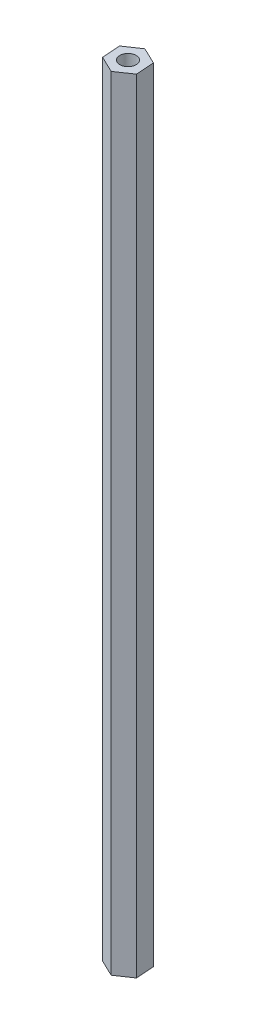
ISO-10303-21;
HEADER;
FILE_DESCRIPTION(('STEP AP214'),'2;1');
FILE_NAME('part.step','',(''),(''),'','','');
FILE_SCHEMA(('AUTOMOTIVE_DESIGN { 1 0 10303 214 1 1 1 1 }'));
ENDSEC;
DATA;
#1=APPLICATION_CONTEXT('core data for automotive mechanical design processes');
#2=APPLICATION_PROTOCOL_DEFINITION('international standard','automotive_design',2000,#1);
#3=PRODUCT_CONTEXT('',#1,'mechanical');
#4=PRODUCT('Part','Part','',(#3));
#5=PRODUCT_RELATED_PRODUCT_CATEGORY('part','',(#4));
#6=PRODUCT_DEFINITION_FORMATION('','',#4);
#7=PRODUCT_DEFINITION_CONTEXT('part definition',#1,'design');
#8=PRODUCT_DEFINITION('design','',#6,#7);
#9=PRODUCT_DEFINITION_SHAPE('','',#8);
#10=(LENGTH_UNIT() NAMED_UNIT(*) SI_UNIT(.MILLI.,.METRE.));
#11=(NAMED_UNIT(*) PLANE_ANGLE_UNIT() SI_UNIT($,.RADIAN.));
#12=(NAMED_UNIT(*) SI_UNIT($,.STERADIAN.) SOLID_ANGLE_UNIT());
#13=UNCERTAINTY_MEASURE_WITH_UNIT(LENGTH_MEASURE(1.E-05),#10,'distance_accuracy_value','');
#14=(GEOMETRIC_REPRESENTATION_CONTEXT(3) GLOBAL_UNCERTAINTY_ASSIGNED_CONTEXT((#13)) GLOBAL_UNIT_ASSIGNED_CONTEXT((#10,
#11,#12)) REPRESENTATION_CONTEXT('',''));
#15=CARTESIAN_POINT('',(0.,0.,0.));
#16=DIRECTION('',(0.,0.,1.));
#17=DIRECTION('',(1.,0.,0.));
#18=AXIS2_PLACEMENT_3D('',#15,#16,#17);
#19=CARTESIAN_POINT('',(6.60730990121914,157.099,3.1791176767438));
#20=DIRECTION('',(-0.997178072559764,0.,0.0750725755918522));
#21=DIRECTION('',(0.0750725755918522,0.,0.997178072559764));
#22=AXIS2_PLACEMENT_3D('',#19,#20,#21);
#23=PLANE('',#22);
#24=DIRECTION('',(-0.0750725755918522,0.,-0.997178072559764));
#25=VECTOR('',#24,1.);
#26=CARTESIAN_POINT('',(6.60730990121914,-157.099,3.1791176767438));
#27=LINE('',#26,#25);
#28=CARTESIAN_POINT('',(6.60730990121914,-157.099,3.1791176767438));
#29=VERTEX_POINT('',#28);
#30=CARTESIAN_POINT('',(6.05685162028986,-157.099,-4.13253938676032));
#31=VERTEX_POINT('',#30);
#32=EDGE_CURVE('E121',#29,#31,#27,.T.);
#33=ORIENTED_EDGE('',*,*,#32,.T.);
#34=DIRECTION('',(0.,-1.,0.));
#35=VECTOR('',#34,1.);
#36=CARTESIAN_POINT('',(6.05685162028986,157.099,-4.13253938676032));
#37=LINE('',#36,#35);
#38=CARTESIAN_POINT('',(6.05685162028986,157.099,-4.13253938676032));
#39=VERTEX_POINT('',#38);
#40=EDGE_CURVE('E11',#39,#31,#37,.T.);
#41=ORIENTED_EDGE('',*,*,#40,.F.);
#42=DIRECTION('',(-0.0750725755918522,0.,-0.997178072559764));
#43=VECTOR('',#42,1.);
#44=CARTESIAN_POINT('',(6.60730990121914,157.099,3.1791176767438));
#45=LINE('',#44,#43);
#46=CARTESIAN_POINT('',(6.60730990121914,157.099,3.1791176767438));
#47=VERTEX_POINT('',#46);
#48=EDGE_CURVE('E132',#47,#39,#45,.T.);
#49=ORIENTED_EDGE('',*,*,#48,.F.);
#50=DIRECTION('',(0.,-1.,0.));
#51=VECTOR('',#50,1.);
#52=CARTESIAN_POINT('',(6.60730990121914,157.099,3.1791176767438));
#53=LINE('',#52,#51);
#54=EDGE_CURVE('E117',#47,#29,#53,.T.);
#55=ORIENTED_EDGE('',*,*,#54,.T.);
#56=EDGE_LOOP('',(#33,#41,#49,#55));
#57=FACE_BOUND('',#56,.T.);
#58=ADVANCED_FACE('F37',(#57),#23,.F.);
#59=CARTESIAN_POINT('',(6.05685162028986,157.099,-4.13253938676032));
#60=DIRECTION('',(-0.433574278689811,0.,0.901117830729484));
#61=DIRECTION('',(0.901117830729484,0.,0.433574278689811));
#62=AXIS2_PLACEMENT_3D('',#59,#60,#61);
#63=PLANE('',#62);
#64=DIRECTION('',(-0.901117830729484,0.,-0.433574278689811));
#65=VECTOR('',#64,1.);
#66=CARTESIAN_POINT('',(6.05685162028986,-157.099,-4.13253938676032));
#67=LINE('',#66,#65);
#68=CARTESIAN_POINT('',(-0.55045828092927,-157.099,-7.31165706350412));
#69=VERTEX_POINT('',#68);
#70=EDGE_CURVE('E124',#31,#69,#67,.T.);
#71=ORIENTED_EDGE('',*,*,#70,.T.);
#72=DIRECTION('',(0.,-1.,0.));
#73=VECTOR('',#72,1.);
#74=CARTESIAN_POINT('',(-0.55045828092927,157.099,-7.31165706350412));
#75=LINE('',#74,#73);
#76=CARTESIAN_POINT('',(-0.55045828092927,157.099,-7.31165706350412));
#77=VERTEX_POINT('',#76);
#78=EDGE_CURVE('E45',#77,#69,#75,.T.);
#79=ORIENTED_EDGE('',*,*,#78,.F.);
#80=DIRECTION('',(-0.901117830729484,0.,-0.433574278689811));
#81=VECTOR('',#80,1.);
#82=CARTESIAN_POINT('',(6.05685162028986,157.099,-4.13253938676032));
#83=LINE('',#82,#81);
#84=EDGE_CURVE('E90',#39,#77,#83,.T.);
#85=ORIENTED_EDGE('',*,*,#84,.F.);
#86=ORIENTED_EDGE('',*,*,#40,.T.);
#87=EDGE_LOOP('',(#71,#79,#85,#86));
#88=FACE_BOUND('',#87,.T.);
#89=ADVANCED_FACE('F157',(#88),#63,.F.);
#90=CARTESIAN_POINT('',(-0.55045828092927,157.099,-7.31165706350412));
#91=DIRECTION('',(0.563603793869954,0.,0.826045255137632));
#92=DIRECTION('',(0.826045255137632,0.,-0.563603793869954));
#93=AXIS2_PLACEMENT_3D('',#90,#91,#92);
#94=PLANE('',#93);
#95=DIRECTION('',(-0.826045255137632,0.,0.563603793869954));
#96=VECTOR('',#95,1.);
#97=CARTESIAN_POINT('',(-0.55045828092927,-157.099,-7.31165706350412));
#98=LINE('',#97,#96);
#99=CARTESIAN_POINT('',(-6.60730990121914,-157.099,-3.1791176767438));
#100=VERTEX_POINT('',#99);
#101=EDGE_CURVE('E127',#69,#100,#98,.T.);
#102=ORIENTED_EDGE('',*,*,#101,.T.);
#103=DIRECTION('',(0.,-1.,0.));
#104=VECTOR('',#103,1.);
#105=CARTESIAN_POINT('',(-6.60730990121914,157.099,-3.1791176767438));
#106=LINE('',#105,#104);
#107=CARTESIAN_POINT('',(-6.60730990121914,157.099,-3.1791176767438));
#108=VERTEX_POINT('',#107);
#109=EDGE_CURVE('E112',#108,#100,#106,.T.);
#110=ORIENTED_EDGE('',*,*,#109,.F.);
#111=DIRECTION('',(-0.826045255137632,0.,0.563603793869954));
#112=VECTOR('',#111,1.);
#113=CARTESIAN_POINT('',(-0.55045828092927,157.099,-7.31165706350412));
#114=LINE('',#113,#112);
#115=EDGE_CURVE('E103',#77,#108,#114,.T.);
#116=ORIENTED_EDGE('',*,*,#115,.F.);
#117=ORIENTED_EDGE('',*,*,#78,.T.);
#118=EDGE_LOOP('',(#102,#110,#116,#117));
#119=FACE_BOUND('',#118,.T.);
#120=ADVANCED_FACE('F138',(#119),#94,.F.);
#121=CARTESIAN_POINT('',(-6.60730990121914,157.099,-3.1791176767438));
#122=DIRECTION('',(0.997178072559764,0.,-0.0750725755918522));
#123=DIRECTION('',(-0.0750725755918522,0.,-0.997178072559764));
#124=AXIS2_PLACEMENT_3D('',#121,#122,#123);
#125=PLANE('',#124);
#126=DIRECTION('',(0.0750725755918522,0.,0.997178072559764));
#127=VECTOR('',#126,1.);
#128=CARTESIAN_POINT('',(-6.60730990121914,-157.099,-3.1791176767438));
#129=LINE('',#128,#127);
#130=CARTESIAN_POINT('',(-6.05685162028986,-157.099,4.13253938676032));
#131=VERTEX_POINT('',#130);
#132=EDGE_CURVE('E111',#100,#131,#129,.T.);
#133=ORIENTED_EDGE('',*,*,#132,.T.);
#134=DIRECTION('',(0.,-1.,0.));
#135=VECTOR('',#134,1.);
#136=CARTESIAN_POINT('',(-6.05685162028986,157.099,4.13253938676032));
#137=LINE('',#136,#135);
#138=CARTESIAN_POINT('',(-6.05685162028986,157.099,4.13253938676032));
#139=VERTEX_POINT('',#138);
#140=EDGE_CURVE('E108',#139,#131,#137,.T.);
#141=ORIENTED_EDGE('',*,*,#140,.F.);
#142=DIRECTION('',(0.0750725755918522,0.,0.997178072559764));
#143=VECTOR('',#142,1.);
#144=CARTESIAN_POINT('',(-6.60730990121914,157.099,-3.1791176767438));
#145=LINE('',#144,#143);
#146=EDGE_CURVE('E97',#108,#139,#145,.T.);
#147=ORIENTED_EDGE('',*,*,#146,.F.);
#148=ORIENTED_EDGE('',*,*,#109,.T.);
#149=EDGE_LOOP('',(#133,#141,#147,#148));
#150=FACE_BOUND('',#149,.T.);
#151=ADVANCED_FACE('F109',(#150),#125,.F.);
#152=CARTESIAN_POINT('',(-6.05685162028986,157.099,4.13253938676032));
#153=DIRECTION('',(0.43357427868981,0.,-0.901117830729484));
#154=DIRECTION('',(-0.901117830729484,0.,-0.43357427868981));
#155=AXIS2_PLACEMENT_3D('',#152,#153,#154);
#156=PLANE('',#155);
#157=DIRECTION('',(0.901117830729484,0.,0.43357427868981));
#158=VECTOR('',#157,1.);
#159=CARTESIAN_POINT('',(-6.05685162028986,-157.099,4.13253938676032));
#160=LINE('',#159,#158);
#161=CARTESIAN_POINT('',(0.550458280929272,-157.099,7.31165706350412));
#162=VERTEX_POINT('',#161);
#163=EDGE_CURVE('E76',#131,#162,#160,.T.);
#164=ORIENTED_EDGE('',*,*,#163,.T.);
#165=DIRECTION('',(0.,-1.,0.));
#166=VECTOR('',#165,1.);
#167=CARTESIAN_POINT('',(0.550458280929272,157.099,7.31165706350412));
#168=LINE('',#167,#166);
#169=CARTESIAN_POINT('',(0.550458280929272,157.099,7.31165706350412));
#170=VERTEX_POINT('',#169);
#171=EDGE_CURVE('E113',#170,#162,#168,.T.);
#172=ORIENTED_EDGE('',*,*,#171,.F.);
#173=DIRECTION('',(0.901117830729484,0.,0.43357427868981));
#174=VECTOR('',#173,1.);
#175=CARTESIAN_POINT('',(-6.05685162028986,157.099,4.13253938676032));
#176=LINE('',#175,#174);
#177=EDGE_CURVE('E101',#139,#170,#176,.T.);
#178=ORIENTED_EDGE('',*,*,#177,.F.);
#179=ORIENTED_EDGE('',*,*,#140,.T.);
#180=EDGE_LOOP('',(#164,#172,#178,#179));
#181=FACE_BOUND('',#180,.T.);
#182=ADVANCED_FACE('F115',(#181),#156,.F.);
#183=CARTESIAN_POINT('',(0.550458280929272,157.099,7.31165706350412));
#184=DIRECTION('',(-0.563603793869953,0.,-0.826045255137632));
#185=DIRECTION('',(-0.826045255137632,0.,0.563603793869954));
#186=AXIS2_PLACEMENT_3D('',#183,#184,#185);
#187=PLANE('',#186);
#188=DIRECTION('',(0.826045255137632,0.,-0.563603793869954));
#189=VECTOR('',#188,1.);
#190=CARTESIAN_POINT('',(0.550458280929272,-157.099,7.31165706350412));
#191=LINE('',#190,#189);
#192=EDGE_CURVE('E82',#162,#29,#191,.T.);
#193=ORIENTED_EDGE('',*,*,#192,.T.);
#194=ORIENTED_EDGE('',*,*,#54,.F.);
#195=DIRECTION('',(0.826045255137632,0.,-0.563603793869954));
#196=VECTOR('',#195,1.);
#197=CARTESIAN_POINT('',(0.550458280929272,157.099,7.31165706350412));
#198=LINE('',#197,#196);
#199=EDGE_CURVE('E53',#170,#47,#198,.T.);
#200=ORIENTED_EDGE('',*,*,#199,.F.);
#201=ORIENTED_EDGE('',*,*,#171,.T.);
#202=EDGE_LOOP('',(#193,#194,#200,#201));
#203=FACE_BOUND('',#202,.T.);
#204=ADVANCED_FACE('F145',(#203),#187,.F.);
#205=CARTESIAN_POINT('',(0.,157.099,0.));
#206=DIRECTION('',(0.,1.,0.));
#207=DIRECTION('',(0.,0.,1.));
#208=AXIS2_PLACEMENT_3D('',#205,#206,#207);
#209=PLANE('',#208);
#210=CARTESIAN_POINT('',(0.,157.099,0.));
#211=DIRECTION('',(0.,1.,0.));
#212=DIRECTION('',(0.,0.,1.));
#213=AXIS2_PLACEMENT_3D('',#210,#211,#212);
#214=CIRCLE('',#213,3.2639);
#215=CARTESIAN_POINT('',(0.,157.099,3.2639));
#216=VERTEX_POINT('',#215);
#217=EDGE_CURVE('E240',#216,#216,#214,.T.);
#218=ORIENTED_EDGE('',*,*,#217,.F.);
#219=EDGE_LOOP('',(#218));
#220=FACE_BOUND('',#219,.T.);
#221=ORIENTED_EDGE('',*,*,#48,.T.);
#222=ORIENTED_EDGE('',*,*,#84,.T.);
#223=ORIENTED_EDGE('',*,*,#115,.T.);
#224=ORIENTED_EDGE('',*,*,#146,.T.);
#225=ORIENTED_EDGE('',*,*,#177,.T.);
#226=ORIENTED_EDGE('',*,*,#199,.T.);
#227=EDGE_LOOP('',(#221,#222,#223,#224,#225,#226));
#228=FACE_BOUND('',#227,.T.);
#229=ADVANCED_FACE('F99',(#220,#228),#209,.T.);
#230=CARTESIAN_POINT('',(0.,-157.099,0.));
#231=DIRECTION('',(0.,1.,0.));
#232=DIRECTION('',(0.,0.,1.));
#233=AXIS2_PLACEMENT_3D('',#230,#231,#232);
#234=PLANE('',#233);
#235=CARTESIAN_POINT('',(0.,-157.099,0.));
#236=DIRECTION('',(0.,1.,0.));
#237=DIRECTION('',(0.,0.,1.));
#238=AXIS2_PLACEMENT_3D('',#235,#236,#237);
#239=CIRCLE('',#238,3.2639);
#240=CARTESIAN_POINT('',(0.,-157.099,3.2639));
#241=VERTEX_POINT('',#240);
#242=EDGE_CURVE('E241',#241,#241,#239,.T.);
#243=ORIENTED_EDGE('',*,*,#242,.T.);
#244=EDGE_LOOP('',(#243));
#245=FACE_BOUND('',#244,.T.);
#246=ORIENTED_EDGE('',*,*,#32,.F.);
#247=ORIENTED_EDGE('',*,*,#192,.F.);
#248=ORIENTED_EDGE('',*,*,#163,.F.);
#249=ORIENTED_EDGE('',*,*,#132,.F.);
#250=ORIENTED_EDGE('',*,*,#101,.F.);
#251=ORIENTED_EDGE('',*,*,#70,.F.);
#252=EDGE_LOOP('',(#246,#247,#248,#249,#250,#251));
#253=FACE_BOUND('',#252,.T.);
#254=ADVANCED_FACE('F141',(#245,#253),#234,.F.);
#255=CARTESIAN_POINT('',(0.,144.399,0.));
#256=DIRECTION('',(0.,1.,0.));
#257=DIRECTION('',(0.,0.,1.));
#258=AXIS2_PLACEMENT_3D('',#255,#256,#257);
#259=CYLINDRICAL_SURFACE('',#258,3.2639);
#260=CARTESIAN_POINT('',(0.,144.399,0.));
#261=DIRECTION('',(0.,1.,0.));
#262=DIRECTION('',(0.,0.,1.));
#263=AXIS2_PLACEMENT_3D('',#260,#261,#262);
#264=CIRCLE('',#263,3.2639);
#265=CARTESIAN_POINT('',(0.,144.399,3.2639));
#266=VERTEX_POINT('',#265);
#267=EDGE_CURVE('E125',#266,#266,#264,.T.);
#268=ORIENTED_EDGE('',*,*,#267,.F.);
#269=EDGE_LOOP('',(#268));
#270=FACE_BOUND('',#269,.T.);
#271=ORIENTED_EDGE('',*,*,#217,.T.);
#272=EDGE_LOOP('',(#271));
#273=FACE_BOUND('',#272,.T.);
#274=ADVANCED_FACE('F192',(#270,#273),#259,.F.);
#275=CARTESIAN_POINT('',(0.,144.399,0.));
#276=DIRECTION('',(0.,1.,0.));
#277=DIRECTION('',(0.,0.,1.));
#278=AXIS2_PLACEMENT_3D('',#275,#276,#277);
#279=PLANE('',#278);
#280=ORIENTED_EDGE('',*,*,#267,.T.);
#281=EDGE_LOOP('',(#280));
#282=FACE_BOUND('',#281,.T.);
#283=ADVANCED_FACE('F197',(#282),#279,.T.);
#284=CARTESIAN_POINT('',(0.,-144.399,0.));
#285=DIRECTION('',(0.,-1.,0.));
#286=DIRECTION('',(0.,0.,-1.));
#287=AXIS2_PLACEMENT_3D('',#284,#285,#286);
#288=CYLINDRICAL_SURFACE('',#287,3.2639);
#289=CARTESIAN_POINT('',(0.,-144.399,0.));
#290=DIRECTION('',(0.,1.,0.));
#291=DIRECTION('',(0.,0.,1.));
#292=AXIS2_PLACEMENT_3D('',#289,#290,#291);
#293=CIRCLE('',#292,3.2639);
#294=CARTESIAN_POINT('',(0.,-144.399,3.2639));
#295=VERTEX_POINT('',#294);
#296=EDGE_CURVE('E239',#295,#295,#293,.T.);
#297=ORIENTED_EDGE('',*,*,#296,.T.);
#298=EDGE_LOOP('',(#297));
#299=FACE_BOUND('',#298,.T.);
#300=ORIENTED_EDGE('',*,*,#242,.F.);
#301=EDGE_LOOP('',(#300));
#302=FACE_BOUND('',#301,.T.);
#303=ADVANCED_FACE('F207',(#299,#302),#288,.F.);
#304=CARTESIAN_POINT('',(0.,-144.399,0.));
#305=DIRECTION('',(0.,-1.,0.));
#306=DIRECTION('',(0.,0.,1.));
#307=AXIS2_PLACEMENT_3D('',#304,#305,#306);
#308=PLANE('',#307);
#309=ORIENTED_EDGE('',*,*,#296,.F.);
#310=EDGE_LOOP('',(#309));
#311=FACE_BOUND('',#310,.T.);
#312=ADVANCED_FACE('F223',(#311),#308,.T.);
#313=CLOSED_SHELL('',(#58,#89,#120,#151,#182,#204,#229,#254,#274,#283,#303,#312));
#314=MANIFOLD_SOLID_BREP('B2',#313);
#315=ADVANCED_BREP_SHAPE_REPRESENTATION('',(#18,#314),#14);
#316=SHAPE_DEFINITION_REPRESENTATION(#9,#315);
ENDSEC;
END-ISO-10303-21;
